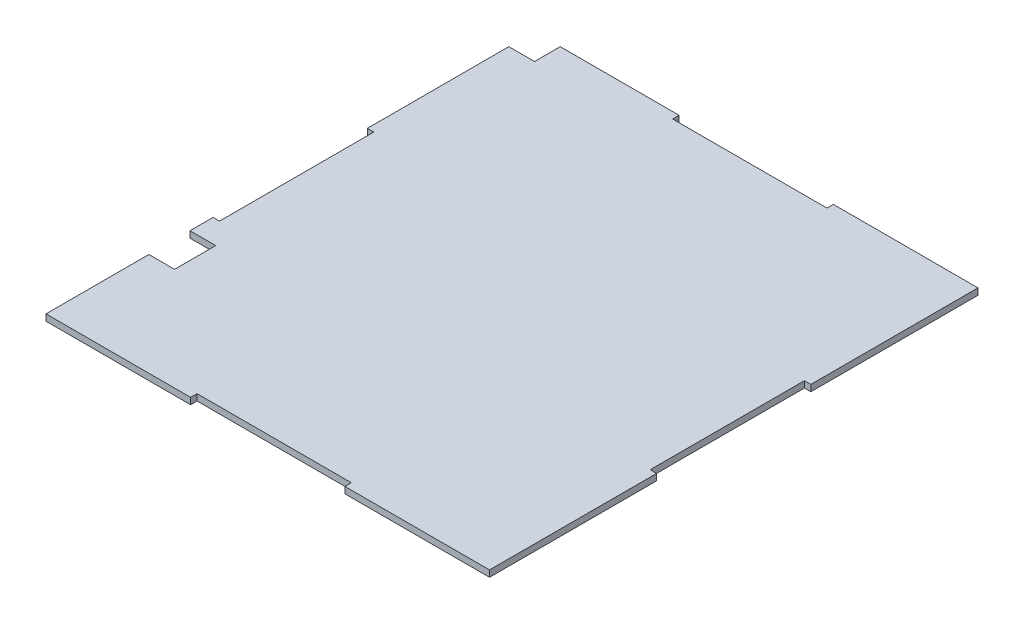
ISO-10303-21;
HEADER;
FILE_DESCRIPTION(('STEP AP214'),'2;1');
FILE_NAME('part.step','',(''),(''),'','','');
FILE_SCHEMA(('AUTOMOTIVE_DESIGN { 1 0 10303 214 1 1 1 1 }'));
ENDSEC;
DATA;
#1=APPLICATION_CONTEXT('core data for automotive mechanical design processes');
#2=APPLICATION_PROTOCOL_DEFINITION('international standard','automotive_design',2000,#1);
#3=PRODUCT_CONTEXT('',#1,'mechanical');
#4=PRODUCT('Part','Part','',(#3));
#5=PRODUCT_RELATED_PRODUCT_CATEGORY('part','',(#4));
#6=PRODUCT_DEFINITION_FORMATION('','',#4);
#7=PRODUCT_DEFINITION_CONTEXT('part definition',#1,'design');
#8=PRODUCT_DEFINITION('design','',#6,#7);
#9=PRODUCT_DEFINITION_SHAPE('','',#8);
#10=(LENGTH_UNIT() NAMED_UNIT(*) SI_UNIT(.MILLI.,.METRE.));
#11=(NAMED_UNIT(*) PLANE_ANGLE_UNIT() SI_UNIT($,.RADIAN.));
#12=(NAMED_UNIT(*) SI_UNIT($,.STERADIAN.) SOLID_ANGLE_UNIT());
#13=UNCERTAINTY_MEASURE_WITH_UNIT(LENGTH_MEASURE(1.E-05),#10,'distance_accuracy_value','');
#14=(GEOMETRIC_REPRESENTATION_CONTEXT(3) GLOBAL_UNCERTAINTY_ASSIGNED_CONTEXT((#13)) GLOBAL_UNIT_ASSIGNED_CONTEXT((#10,
#11,#12)) REPRESENTATION_CONTEXT('',''));
#15=CARTESIAN_POINT('',(0.,0.,0.));
#16=DIRECTION('',(0.,0.,1.));
#17=DIRECTION('',(1.,0.,0.));
#18=AXIS2_PLACEMENT_3D('',#15,#16,#17);
#19=CARTESIAN_POINT('',(0.,3.175,0.));
#20=DIRECTION('',(1.,0.,0.));
#21=DIRECTION('',(0.,0.,-1.));
#22=AXIS2_PLACEMENT_3D('',#19,#20,#21);
#23=PLANE('',#22);
#24=DIRECTION('',(0.,0.,1.));
#25=VECTOR('',#24,1.);
#26=CARTESIAN_POINT('',(0.,0.,0.));
#27=LINE('',#26,#25);
#28=CARTESIAN_POINT('',(0.,0.,-82.55));
#29=VERTEX_POINT('',#28);
#30=CARTESIAN_POINT('',(0.,0.,-71.12));
#31=VERTEX_POINT('',#30);
#32=EDGE_CURVE('E233',#29,#31,#27,.T.);
#33=ORIENTED_EDGE('',*,*,#32,.T.);
#34=DIRECTION('',(0.,1.,0.));
#35=VECTOR('',#34,1.);
#36=CARTESIAN_POINT('',(0.,0.,-71.12));
#37=LINE('',#36,#35);
#38=CARTESIAN_POINT('',(0.,3.175,-71.12));
#39=VERTEX_POINT('',#38);
#40=EDGE_CURVE('E314',#31,#39,#37,.T.);
#41=ORIENTED_EDGE('',*,*,#40,.T.);
#42=DIRECTION('',(0.,0.,1.));
#43=VECTOR('',#42,1.);
#44=CARTESIAN_POINT('',(0.,3.175,0.));
#45=LINE('',#44,#43);
#46=CARTESIAN_POINT('',(0.,3.175,-82.55));
#47=VERTEX_POINT('',#46);
#48=EDGE_CURVE('E259',#47,#39,#45,.T.);
#49=ORIENTED_EDGE('',*,*,#48,.F.);
#50=DIRECTION('',(0.,1.,0.));
#51=VECTOR('',#50,1.);
#52=CARTESIAN_POINT('',(0.,0.,-82.55));
#53=LINE('',#52,#51);
#54=EDGE_CURVE('E255',#29,#47,#53,.T.);
#55=ORIENTED_EDGE('',*,*,#54,.F.);
#56=EDGE_LOOP('',(#33,#41,#49,#55));
#57=FACE_BOUND('',#56,.T.);
#58=ADVANCED_FACE('F36',(#57),#23,.F.);
#59=CARTESIAN_POINT('',(0.,3.175,0.));
#60=DIRECTION('',(0.,0.,-1.));
#61=DIRECTION('',(-1.,0.,0.));
#62=AXIS2_PLACEMENT_3D('',#59,#60,#61);
#63=PLANE('',#62);
#64=DIRECTION('',(1.,0.,0.));
#65=VECTOR('',#64,1.);
#66=CARTESIAN_POINT('',(0.,0.,0.));
#67=LINE('',#66,#65);
#68=CARTESIAN_POINT('',(0.,0.,0.));
#69=VERTEX_POINT('',#68);
#70=CARTESIAN_POINT('',(71.4374999999998,0.,0.));
#71=VERTEX_POINT('',#70);
#72=EDGE_CURVE('E236',#69,#71,#67,.T.);
#73=ORIENTED_EDGE('',*,*,#72,.T.);
#74=DIRECTION('',(0.,1.,0.));
#75=VECTOR('',#74,1.);
#76=CARTESIAN_POINT('',(71.4374999999998,0.,0.));
#77=LINE('',#76,#75);
#78=CARTESIAN_POINT('',(71.4374999999998,3.175,0.));
#79=VERTEX_POINT('',#78);
#80=EDGE_CURVE('E384',#71,#79,#77,.T.);
#81=ORIENTED_EDGE('',*,*,#80,.T.);
#82=DIRECTION('',(1.,0.,0.));
#83=VECTOR('',#82,1.);
#84=CARTESIAN_POINT('',(0.,3.175,0.));
#85=LINE('',#84,#83);
#86=CARTESIAN_POINT('',(0.,3.175,0.));
#87=VERTEX_POINT('',#86);
#88=EDGE_CURVE('E261',#87,#79,#85,.T.);
#89=ORIENTED_EDGE('',*,*,#88,.F.);
#90=DIRECTION('',(0.,-1.,0.));
#91=VECTOR('',#90,1.);
#92=CARTESIAN_POINT('',(0.,3.175,0.));
#93=LINE('',#92,#91);
#94=EDGE_CURVE('E11',#87,#69,#93,.T.);
#95=ORIENTED_EDGE('',*,*,#94,.T.);
#96=EDGE_LOOP('',(#73,#81,#89,#95));
#97=FACE_BOUND('',#96,.T.);
#98=ADVANCED_FACE('F454',(#97),#63,.F.);
#99=CARTESIAN_POINT('',(219.075,3.175,0.));
#100=DIRECTION('',(-1.,0.,0.));
#101=DIRECTION('',(0.,0.,1.));
#102=AXIS2_PLACEMENT_3D('',#99,#100,#101);
#103=PLANE('',#102);
#104=DIRECTION('',(0.,0.,-1.));
#105=VECTOR('',#104,1.);
#106=CARTESIAN_POINT('',(219.075,3.175,0.));
#107=LINE('',#106,#105);
#108=CARTESIAN_POINT('',(219.075,3.175,-158.75));
#109=VERTEX_POINT('',#108);
#110=CARTESIAN_POINT('',(219.075,3.175,-241.3));
#111=VERTEX_POINT('',#110);
#112=EDGE_CURVE('E264',#109,#111,#107,.T.);
#113=ORIENTED_EDGE('',*,*,#112,.F.);
#114=DIRECTION('',(0.,1.,0.));
#115=VECTOR('',#114,1.);
#116=CARTESIAN_POINT('',(219.075,0.,-158.75));
#117=LINE('',#116,#115);
#118=CARTESIAN_POINT('',(219.075,0.,-158.75));
#119=VERTEX_POINT('',#118);
#120=EDGE_CURVE('E345',#119,#109,#117,.T.);
#121=ORIENTED_EDGE('',*,*,#120,.F.);
#122=DIRECTION('',(0.,0.,-1.));
#123=VECTOR('',#122,1.);
#124=CARTESIAN_POINT('',(219.075,0.,0.));
#125=LINE('',#124,#123);
#126=CARTESIAN_POINT('',(219.075,0.,-241.3));
#127=VERTEX_POINT('',#126);
#128=EDGE_CURVE('E421',#119,#127,#125,.T.);
#129=ORIENTED_EDGE('',*,*,#128,.T.);
#130=DIRECTION('',(0.,-1.,0.));
#131=VECTOR('',#130,1.);
#132=CARTESIAN_POINT('',(219.075,3.175,-241.3));
#133=LINE('',#132,#131);
#134=EDGE_CURVE('E270',#111,#127,#133,.T.);
#135=ORIENTED_EDGE('',*,*,#134,.F.);
#136=EDGE_LOOP('',(#113,#121,#129,#135));
#137=FACE_BOUND('',#136,.T.);
#138=ADVANCED_FACE('F479',(#137),#103,.F.);
#139=CARTESIAN_POINT('',(0.,3.175,-241.3));
#140=DIRECTION('',(0.,0.,1.));
#141=DIRECTION('',(1.,0.,0.));
#142=AXIS2_PLACEMENT_3D('',#139,#140,#141);
#143=PLANE('',#142);
#144=DIRECTION('',(-1.,0.,0.));
#145=VECTOR('',#144,1.);
#146=CARTESIAN_POINT('',(0.,0.,-241.3));
#147=LINE('',#146,#145);
#148=CARTESIAN_POINT('',(147.6375,0.,-241.3));
#149=VERTEX_POINT('',#148);
#150=EDGE_CURVE('E416',#127,#149,#147,.T.);
#151=ORIENTED_EDGE('',*,*,#150,.T.);
#152=DIRECTION('',(0.,1.,0.));
#153=VECTOR('',#152,1.);
#154=CARTESIAN_POINT('',(147.6375,0.,-241.3));
#155=LINE('',#154,#153);
#156=CARTESIAN_POINT('',(147.6375,3.175,-241.3));
#157=VERTEX_POINT('',#156);
#158=EDGE_CURVE('E361',#149,#157,#155,.T.);
#159=ORIENTED_EDGE('',*,*,#158,.T.);
#160=DIRECTION('',(-1.,0.,0.));
#161=VECTOR('',#160,1.);
#162=CARTESIAN_POINT('',(0.,3.175,-241.3));
#163=LINE('',#162,#161);
#164=EDGE_CURVE('E268',#111,#157,#163,.T.);
#165=ORIENTED_EDGE('',*,*,#164,.F.);
#166=ORIENTED_EDGE('',*,*,#134,.T.);
#167=EDGE_LOOP('',(#151,#159,#165,#166));
#168=FACE_BOUND('',#167,.T.);
#169=ADVANCED_FACE('F474',(#168),#143,.F.);
#170=CARTESIAN_POINT('',(0.,3.175,-228.6));
#171=VERTEX_POINT('',#170);
#172=CARTESIAN_POINT('',(0.,3.175,-158.75));
#173=VERTEX_POINT('',#172);
#174=EDGE_CURVE('E225',#171,#173,#45,.T.);
#175=ORIENTED_EDGE('',*,*,#174,.F.);
#176=DIRECTION('',(0.,1.,0.));
#177=VECTOR('',#176,1.);
#178=CARTESIAN_POINT('',(0.,0.,-228.6));
#179=LINE('',#178,#177);
#180=CARTESIAN_POINT('',(0.,0.,-228.6));
#181=VERTEX_POINT('',#180);
#182=EDGE_CURVE('E212',#181,#171,#179,.T.);
#183=ORIENTED_EDGE('',*,*,#182,.F.);
#184=CARTESIAN_POINT('',(0.,0.,-158.75));
#185=VERTEX_POINT('',#184);
#186=EDGE_CURVE('E223',#181,#185,#27,.T.);
#187=ORIENTED_EDGE('',*,*,#186,.T.);
#188=DIRECTION('',(0.,1.,0.));
#189=VECTOR('',#188,1.);
#190=CARTESIAN_POINT('',(0.,0.,-158.75));
#191=LINE('',#190,#189);
#192=EDGE_CURVE('E240',#185,#173,#191,.T.);
#193=ORIENTED_EDGE('',*,*,#192,.T.);
#194=EDGE_LOOP('',(#175,#183,#187,#193));
#195=FACE_BOUND('',#194,.T.);
#196=ADVANCED_FACE('F221',(#195),#23,.F.);
#197=CARTESIAN_POINT('',(0.,3.175,-50.8));
#198=VERTEX_POINT('',#197);
#199=EDGE_CURVE('E260',#198,#87,#45,.T.);
#200=ORIENTED_EDGE('',*,*,#199,.F.);
#201=DIRECTION('',(0.,1.,0.));
#202=VECTOR('',#201,1.);
#203=CARTESIAN_POINT('',(0.,0.,-50.8));
#204=LINE('',#203,#202);
#205=CARTESIAN_POINT('',(0.,0.,-50.8));
#206=VERTEX_POINT('',#205);
#207=EDGE_CURVE('E309',#206,#198,#204,.T.);
#208=ORIENTED_EDGE('',*,*,#207,.F.);
#209=EDGE_CURVE('E235',#206,#69,#27,.T.);
#210=ORIENTED_EDGE('',*,*,#209,.T.);
#211=ORIENTED_EDGE('',*,*,#94,.F.);
#212=EDGE_LOOP('',(#200,#208,#210,#211));
#213=FACE_BOUND('',#212,.T.);
#214=ADVANCED_FACE('F38',(#213),#23,.F.);
#215=CARTESIAN_POINT('',(147.6375,3.175,0.));
#216=VERTEX_POINT('',#215);
#217=CARTESIAN_POINT('',(219.075,3.175,0.));
#218=VERTEX_POINT('',#217);
#219=EDGE_CURVE('E258',#216,#218,#85,.T.);
#220=ORIENTED_EDGE('',*,*,#219,.F.);
#221=DIRECTION('',(0.,1.,0.));
#222=VECTOR('',#221,1.);
#223=CARTESIAN_POINT('',(147.6375,0.,0.));
#224=LINE('',#223,#222);
#225=CARTESIAN_POINT('',(147.6375,0.,0.));
#226=VERTEX_POINT('',#225);
#227=EDGE_CURVE('E394',#226,#216,#224,.T.);
#228=ORIENTED_EDGE('',*,*,#227,.F.);
#229=CARTESIAN_POINT('',(219.075,0.,0.));
#230=VERTEX_POINT('',#229);
#231=EDGE_CURVE('E232',#226,#230,#67,.T.);
#232=ORIENTED_EDGE('',*,*,#231,.T.);
#233=DIRECTION('',(0.,-1.,0.));
#234=VECTOR('',#233,1.);
#235=CARTESIAN_POINT('',(219.075,3.175,0.));
#236=LINE('',#235,#234);
#237=EDGE_CURVE('E44',#218,#230,#236,.T.);
#238=ORIENTED_EDGE('',*,*,#237,.F.);
#239=EDGE_LOOP('',(#220,#228,#232,#238));
#240=FACE_BOUND('',#239,.T.);
#241=ADVANCED_FACE('F441',(#240),#63,.F.);
#242=CARTESIAN_POINT('',(219.075,0.,-82.55));
#243=VERTEX_POINT('',#242);
#244=EDGE_CURVE('E417',#230,#243,#125,.T.);
#245=ORIENTED_EDGE('',*,*,#244,.T.);
#246=DIRECTION('',(0.,1.,0.));
#247=VECTOR('',#246,1.);
#248=CARTESIAN_POINT('',(219.075,0.,-82.55));
#249=LINE('',#248,#247);
#250=CARTESIAN_POINT('',(219.075,3.175,-82.55));
#251=VERTEX_POINT('',#250);
#252=EDGE_CURVE('E347',#243,#251,#249,.T.);
#253=ORIENTED_EDGE('',*,*,#252,.T.);
#254=EDGE_CURVE('E265',#218,#251,#107,.T.);
#255=ORIENTED_EDGE('',*,*,#254,.F.);
#256=ORIENTED_EDGE('',*,*,#237,.T.);
#257=EDGE_LOOP('',(#245,#253,#255,#256));
#258=FACE_BOUND('',#257,.T.);
#259=ADVANCED_FACE('F428',(#258),#103,.F.);
#260=CARTESIAN_POINT('',(71.4374999999998,0.,-241.3));
#261=VERTEX_POINT('',#260);
#262=CARTESIAN_POINT('',(12.7,0.,-241.3));
#263=VERTEX_POINT('',#262);
#264=EDGE_CURVE('E292',#261,#263,#147,.T.);
#265=ORIENTED_EDGE('',*,*,#264,.T.);
#266=DIRECTION('',(0.,1.,0.));
#267=VECTOR('',#266,1.);
#268=CARTESIAN_POINT('',(12.7,0.,-241.3));
#269=LINE('',#268,#267);
#270=CARTESIAN_POINT('',(12.7,3.175,-241.3));
#271=VERTEX_POINT('',#270);
#272=EDGE_CURVE('E291',#263,#271,#269,.T.);
#273=ORIENTED_EDGE('',*,*,#272,.T.);
#274=CARTESIAN_POINT('',(71.4374999999998,3.175,-241.3));
#275=VERTEX_POINT('',#274);
#276=EDGE_CURVE('E267',#275,#271,#163,.T.);
#277=ORIENTED_EDGE('',*,*,#276,.F.);
#278=DIRECTION('',(0.,1.,0.));
#279=VECTOR('',#278,1.);
#280=CARTESIAN_POINT('',(71.4374999999998,0.,-241.3));
#281=LINE('',#280,#279);
#282=EDGE_CURVE('E289',#261,#275,#281,.T.);
#283=ORIENTED_EDGE('',*,*,#282,.F.);
#284=EDGE_LOOP('',(#265,#273,#277,#283));
#285=FACE_BOUND('',#284,.T.);
#286=ADVANCED_FACE('F288',(#285),#143,.F.);
#287=CARTESIAN_POINT('',(0.,3.175,0.));
#288=DIRECTION('',(0.,-1.,0.));
#289=DIRECTION('',(0.,0.,-1.));
#290=AXIS2_PLACEMENT_3D('',#287,#288,#289);
#291=PLANE('',#290);
#292=ORIENTED_EDGE('',*,*,#276,.T.);
#293=DIRECTION('',(0.,0.,-1.));
#294=VECTOR('',#293,1.);
#295=CARTESIAN_POINT('',(12.7,3.175,-241.3));
#296=LINE('',#295,#294);
#297=CARTESIAN_POINT('',(12.7,3.175,-228.6));
#298=VERTEX_POINT('',#297);
#299=EDGE_CURVE('E217',#298,#271,#296,.T.);
#300=ORIENTED_EDGE('',*,*,#299,.F.);
#301=DIRECTION('',(1.,0.,0.));
#302=VECTOR('',#301,1.);
#303=CARTESIAN_POINT('',(0.,3.175,-228.6));
#304=LINE('',#303,#302);
#305=EDGE_CURVE('E414',#171,#298,#304,.T.);
#306=ORIENTED_EDGE('',*,*,#305,.F.);
#307=ORIENTED_EDGE('',*,*,#174,.T.);
#308=DIRECTION('',(-1.,0.,0.));
#309=VECTOR('',#308,1.);
#310=CARTESIAN_POINT('',(3.17500000000001,3.175,-158.75));
#311=LINE('',#310,#309);
#312=CARTESIAN_POINT('',(3.17500000000001,3.175,-158.75));
#313=VERTEX_POINT('',#312);
#314=EDGE_CURVE('E251',#313,#173,#311,.T.);
#315=ORIENTED_EDGE('',*,*,#314,.F.);
#316=DIRECTION('',(0.,0.,-1.));
#317=VECTOR('',#316,1.);
#318=CARTESIAN_POINT('',(3.17500000000001,3.175,-158.75));
#319=LINE('',#318,#317);
#320=CARTESIAN_POINT('',(3.17500000000002,3.175,-82.55));
#321=VERTEX_POINT('',#320);
#322=EDGE_CURVE('E405',#321,#313,#319,.T.);
#323=ORIENTED_EDGE('',*,*,#322,.F.);
#324=DIRECTION('',(1.,0.,0.));
#325=VECTOR('',#324,1.);
#326=CARTESIAN_POINT('',(3.17500000000002,3.175,-82.55));
#327=LINE('',#326,#325);
#328=EDGE_CURVE('E344',#47,#321,#327,.T.);
#329=ORIENTED_EDGE('',*,*,#328,.F.);
#330=ORIENTED_EDGE('',*,*,#48,.T.);
#331=DIRECTION('',(-1.,0.,0.));
#332=VECTOR('',#331,1.);
#333=CARTESIAN_POINT('',(0.,3.175,-71.12));
#334=LINE('',#333,#332);
#335=CARTESIAN_POINT('',(12.7,3.175,-71.12));
#336=VERTEX_POINT('',#335);
#337=EDGE_CURVE('E305',#336,#39,#334,.T.);
#338=ORIENTED_EDGE('',*,*,#337,.F.);
#339=DIRECTION('',(0.,0.,-1.));
#340=VECTOR('',#339,1.);
#341=CARTESIAN_POINT('',(12.7,3.175,-71.12));
#342=LINE('',#341,#340);
#343=CARTESIAN_POINT('',(12.7,3.175,-50.8));
#344=VERTEX_POINT('',#343);
#345=EDGE_CURVE('E296',#344,#336,#342,.T.);
#346=ORIENTED_EDGE('',*,*,#345,.F.);
#347=DIRECTION('',(1.,0.,0.));
#348=VECTOR('',#347,1.);
#349=CARTESIAN_POINT('',(0.,3.175,-50.8));
#350=LINE('',#349,#348);
#351=EDGE_CURVE('E293',#198,#344,#350,.T.);
#352=ORIENTED_EDGE('',*,*,#351,.F.);
#353=ORIENTED_EDGE('',*,*,#199,.T.);
#354=ORIENTED_EDGE('',*,*,#88,.T.);
#355=DIRECTION('',(0.,0.,1.));
#356=VECTOR('',#355,1.);
#357=CARTESIAN_POINT('',(71.4374999999998,3.175,0.));
#358=LINE('',#357,#356);
#359=CARTESIAN_POINT('',(71.4374999999998,3.175,-3.17500000000001));
#360=VERTEX_POINT('',#359);
#361=EDGE_CURVE('E317',#360,#79,#358,.T.);
#362=ORIENTED_EDGE('',*,*,#361,.F.);
#363=DIRECTION('',(-1.,0.,0.));
#364=VECTOR('',#363,1.);
#365=CARTESIAN_POINT('',(71.4374999999998,3.175,-3.17500000000001));
#366=LINE('',#365,#364);
#367=CARTESIAN_POINT('',(147.6375,3.175,-3.17499999999998));
#368=VERTEX_POINT('',#367);
#369=EDGE_CURVE('E378',#368,#360,#366,.T.);
#370=ORIENTED_EDGE('',*,*,#369,.F.);
#371=DIRECTION('',(0.,0.,-1.));
#372=VECTOR('',#371,1.);
#373=CARTESIAN_POINT('',(147.6375,3.175,0.));
#374=LINE('',#373,#372);
#375=EDGE_CURVE('E386',#216,#368,#374,.T.);
#376=ORIENTED_EDGE('',*,*,#375,.F.);
#377=ORIENTED_EDGE('',*,*,#219,.T.);
#378=ORIENTED_EDGE('',*,*,#254,.T.);
#379=DIRECTION('',(1.,0.,0.));
#380=VECTOR('',#379,1.);
#381=CARTESIAN_POINT('',(215.9,3.175,-82.55));
#382=LINE('',#381,#380);
#383=CARTESIAN_POINT('',(215.9,3.175,-82.55));
#384=VERTEX_POINT('',#383);
#385=EDGE_CURVE('E337',#384,#251,#382,.T.);
#386=ORIENTED_EDGE('',*,*,#385,.F.);
#387=DIRECTION('',(0.,0.,1.));
#388=VECTOR('',#387,1.);
#389=CARTESIAN_POINT('',(215.9,3.175,-158.75));
#390=LINE('',#389,#388);
#391=CARTESIAN_POINT('',(215.9,3.175,-158.75));
#392=VERTEX_POINT('',#391);
#393=EDGE_CURVE('E334',#392,#384,#390,.T.);
#394=ORIENTED_EDGE('',*,*,#393,.F.);
#395=DIRECTION('',(-1.,0.,0.));
#396=VECTOR('',#395,1.);
#397=CARTESIAN_POINT('',(215.9,3.175,-158.75));
#398=LINE('',#397,#396);
#399=EDGE_CURVE('E327',#109,#392,#398,.T.);
#400=ORIENTED_EDGE('',*,*,#399,.F.);
#401=ORIENTED_EDGE('',*,*,#112,.T.);
#402=ORIENTED_EDGE('',*,*,#164,.T.);
#403=DIRECTION('',(0.,0.,-1.));
#404=VECTOR('',#403,1.);
#405=CARTESIAN_POINT('',(147.6375,3.175,-241.3));
#406=LINE('',#405,#404);
#407=CARTESIAN_POINT('',(147.6375,3.175,-238.125));
#408=VERTEX_POINT('',#407);
#409=EDGE_CURVE('E362',#408,#157,#406,.T.);
#410=ORIENTED_EDGE('',*,*,#409,.F.);
#411=DIRECTION('',(1.,0.,0.));
#412=VECTOR('',#411,1.);
#413=CARTESIAN_POINT('',(71.4374999999998,3.175,-238.125));
#414=LINE('',#413,#412);
#415=CARTESIAN_POINT('',(71.4374999999998,3.175,-238.125));
#416=VERTEX_POINT('',#415);
#417=EDGE_CURVE('E355',#416,#408,#414,.T.);
#418=ORIENTED_EDGE('',*,*,#417,.F.);
#419=DIRECTION('',(0.,0.,1.));
#420=VECTOR('',#419,1.);
#421=CARTESIAN_POINT('',(71.4374999999998,3.175,-241.3));
#422=LINE('',#421,#420);
#423=EDGE_CURVE('E283',#275,#416,#422,.T.);
#424=ORIENTED_EDGE('',*,*,#423,.F.);
#425=EDGE_LOOP('',(#292,#300,#306,#307,#315,#323,#329,#330,#338,#346,#352,#353,#354,#362,#370,
#376,#377,#378,#386,#394,#400,#401,#402,#410,#418,#424));
#426=FACE_BOUND('',#425,.T.);
#427=ADVANCED_FACE('F280',(#426),#291,.F.);
#428=CARTESIAN_POINT('',(0.,0.,0.));
#429=DIRECTION('',(0.,-1.,0.));
#430=DIRECTION('',(0.,0.,-1.));
#431=AXIS2_PLACEMENT_3D('',#428,#429,#430);
#432=PLANE('',#431);
#433=DIRECTION('',(0.,0.,-1.));
#434=VECTOR('',#433,1.);
#435=CARTESIAN_POINT('',(12.7,0.,-241.3));
#436=LINE('',#435,#434);
#437=CARTESIAN_POINT('',(12.7,0.,-228.6));
#438=VERTEX_POINT('',#437);
#439=EDGE_CURVE('E51',#438,#263,#436,.T.);
#440=ORIENTED_EDGE('',*,*,#439,.T.);
#441=ORIENTED_EDGE('',*,*,#264,.F.);
#442=DIRECTION('',(0.,0.,1.));
#443=VECTOR('',#442,1.);
#444=CARTESIAN_POINT('',(71.4374999999998,0.,-241.3));
#445=LINE('',#444,#443);
#446=CARTESIAN_POINT('',(71.4374999999998,0.,-238.125));
#447=VERTEX_POINT('',#446);
#448=EDGE_CURVE('E354',#261,#447,#445,.T.);
#449=ORIENTED_EDGE('',*,*,#448,.T.);
#450=DIRECTION('',(1.,0.,0.));
#451=VECTOR('',#450,1.);
#452=CARTESIAN_POINT('',(71.4374999999998,0.,-238.125));
#453=LINE('',#452,#451);
#454=CARTESIAN_POINT('',(147.6375,0.,-238.125));
#455=VERTEX_POINT('',#454);
#456=EDGE_CURVE('E358',#447,#455,#453,.T.);
#457=ORIENTED_EDGE('',*,*,#456,.T.);
#458=DIRECTION('',(0.,0.,-1.));
#459=VECTOR('',#458,1.);
#460=CARTESIAN_POINT('',(147.6375,0.,-241.3));
#461=LINE('',#460,#459);
#462=EDGE_CURVE('E351',#455,#149,#461,.T.);
#463=ORIENTED_EDGE('',*,*,#462,.T.);
#464=ORIENTED_EDGE('',*,*,#150,.F.);
#465=ORIENTED_EDGE('',*,*,#128,.F.);
#466=DIRECTION('',(-1.,0.,0.));
#467=VECTOR('',#466,1.);
#468=CARTESIAN_POINT('',(215.9,0.,-158.75));
#469=LINE('',#468,#467);
#470=CARTESIAN_POINT('',(215.9,0.,-158.75));
#471=VERTEX_POINT('',#470);
#472=EDGE_CURVE('E330',#119,#471,#469,.T.);
#473=ORIENTED_EDGE('',*,*,#472,.T.);
#474=DIRECTION('',(0.,0.,1.));
#475=VECTOR('',#474,1.);
#476=CARTESIAN_POINT('',(215.9,0.,-158.75));
#477=LINE('',#476,#475);
#478=CARTESIAN_POINT('',(215.9,0.,-82.55));
#479=VERTEX_POINT('',#478);
#480=EDGE_CURVE('E323',#471,#479,#477,.T.);
#481=ORIENTED_EDGE('',*,*,#480,.T.);
#482=DIRECTION('',(1.,0.,0.));
#483=VECTOR('',#482,1.);
#484=CARTESIAN_POINT('',(215.9,0.,-82.55));
#485=LINE('',#484,#483);
#486=EDGE_CURVE('E326',#479,#243,#485,.T.);
#487=ORIENTED_EDGE('',*,*,#486,.T.);
#488=ORIENTED_EDGE('',*,*,#244,.F.);
#489=ORIENTED_EDGE('',*,*,#231,.F.);
#490=DIRECTION('',(0.,0.,-1.));
#491=VECTOR('',#490,1.);
#492=CARTESIAN_POINT('',(147.6375,0.,0.));
#493=LINE('',#492,#491);
#494=CARTESIAN_POINT('',(147.6375,0.,-3.17499999999998));
#495=VERTEX_POINT('',#494);
#496=EDGE_CURVE('E377',#226,#495,#493,.T.);
#497=ORIENTED_EDGE('',*,*,#496,.T.);
#498=DIRECTION('',(-1.,0.,0.));
#499=VECTOR('',#498,1.);
#500=CARTESIAN_POINT('',(71.4374999999998,0.,-3.17500000000001));
#501=LINE('',#500,#499);
#502=CARTESIAN_POINT('',(71.4374999999998,0.,-3.17500000000001));
#503=VERTEX_POINT('',#502);
#504=EDGE_CURVE('E381',#495,#503,#501,.T.);
#505=ORIENTED_EDGE('',*,*,#504,.T.);
#506=DIRECTION('',(0.,0.,1.));
#507=VECTOR('',#506,1.);
#508=CARTESIAN_POINT('',(71.4374999999998,0.,0.));
#509=LINE('',#508,#507);
#510=EDGE_CURVE('E374',#503,#71,#509,.T.);
#511=ORIENTED_EDGE('',*,*,#510,.T.);
#512=ORIENTED_EDGE('',*,*,#72,.F.);
#513=ORIENTED_EDGE('',*,*,#209,.F.);
#514=DIRECTION('',(1.,0.,0.));
#515=VECTOR('',#514,1.);
#516=CARTESIAN_POINT('',(0.,0.,-50.8));
#517=LINE('',#516,#515);
#518=CARTESIAN_POINT('',(12.7,0.,-50.8));
#519=VERTEX_POINT('',#518);
#520=EDGE_CURVE('E302',#206,#519,#517,.T.);
#521=ORIENTED_EDGE('',*,*,#520,.T.);
#522=DIRECTION('',(0.,0.,-1.));
#523=VECTOR('',#522,1.);
#524=CARTESIAN_POINT('',(12.7,0.,-71.12));
#525=LINE('',#524,#523);
#526=CARTESIAN_POINT('',(12.7,0.,-71.12));
#527=VERTEX_POINT('',#526);
#528=EDGE_CURVE('E59',#519,#527,#525,.T.);
#529=ORIENTED_EDGE('',*,*,#528,.T.);
#530=DIRECTION('',(-1.,0.,0.));
#531=VECTOR('',#530,1.);
#532=CARTESIAN_POINT('',(0.,0.,-71.12));
#533=LINE('',#532,#531);
#534=EDGE_CURVE('E307',#527,#31,#533,.T.);
#535=ORIENTED_EDGE('',*,*,#534,.T.);
#536=ORIENTED_EDGE('',*,*,#32,.F.);
#537=DIRECTION('',(1.,0.,0.));
#538=VECTOR('',#537,1.);
#539=CARTESIAN_POINT('',(3.17500000000002,0.,-82.55));
#540=LINE('',#539,#538);
#541=CARTESIAN_POINT('',(3.17500000000002,0.,-82.55));
#542=VERTEX_POINT('',#541);
#543=EDGE_CURVE('E398',#29,#542,#540,.T.);
#544=ORIENTED_EDGE('',*,*,#543,.T.);
#545=DIRECTION('',(0.,0.,-1.));
#546=VECTOR('',#545,1.);
#547=CARTESIAN_POINT('',(3.17500000000001,0.,-158.75));
#548=LINE('',#547,#546);
#549=CARTESIAN_POINT('',(3.17500000000001,0.,-158.75));
#550=VERTEX_POINT('',#549);
#551=EDGE_CURVE('E401',#542,#550,#548,.T.);
#552=ORIENTED_EDGE('',*,*,#551,.T.);
#553=DIRECTION('',(-1.,0.,0.));
#554=VECTOR('',#553,1.);
#555=CARTESIAN_POINT('',(3.17500000000001,0.,-158.75));
#556=LINE('',#555,#554);
#557=EDGE_CURVE('E231',#550,#185,#556,.T.);
#558=ORIENTED_EDGE('',*,*,#557,.T.);
#559=ORIENTED_EDGE('',*,*,#186,.F.);
#560=DIRECTION('',(1.,0.,0.));
#561=VECTOR('',#560,1.);
#562=CARTESIAN_POINT('',(0.,0.,-228.6));
#563=LINE('',#562,#561);
#564=EDGE_CURVE('E208',#181,#438,#563,.T.);
#565=ORIENTED_EDGE('',*,*,#564,.T.);
#566=EDGE_LOOP('',(#440,#441,#449,#457,#463,#464,#465,#473,#481,#487,#488,#489,#497,#505,#511,
#512,#513,#521,#529,#535,#536,#544,#552,#558,#559,#565));
#567=FACE_BOUND('',#566,.T.);
#568=ADVANCED_FACE('F228',(#567),#432,.T.);
#569=CARTESIAN_POINT('',(3.17500000000001,0.,-158.75));
#570=DIRECTION('',(0.,0.,-1.));
#571=DIRECTION('',(-1.,0.,0.));
#572=AXIS2_PLACEMENT_3D('',#569,#570,#571);
#573=PLANE('',#572);
#574=ORIENTED_EDGE('',*,*,#314,.T.);
#575=ORIENTED_EDGE('',*,*,#192,.F.);
#576=ORIENTED_EDGE('',*,*,#557,.F.);
#577=DIRECTION('',(0.,1.,0.));
#578=VECTOR('',#577,1.);
#579=CARTESIAN_POINT('',(3.17500000000001,0.,-158.75));
#580=LINE('',#579,#578);
#581=EDGE_CURVE('E246',#550,#313,#580,.T.);
#582=ORIENTED_EDGE('',*,*,#581,.T.);
#583=EDGE_LOOP('',(#574,#575,#576,#582));
#584=FACE_BOUND('',#583,.T.);
#585=ADVANCED_FACE('F412',(#584),#573,.F.);
#586=CARTESIAN_POINT('',(3.17500000000001,0.,-158.75));
#587=DIRECTION('',(1.,0.,0.));
#588=DIRECTION('',(0.,0.,-1.));
#589=AXIS2_PLACEMENT_3D('',#586,#587,#588);
#590=PLANE('',#589);
#591=ORIENTED_EDGE('',*,*,#322,.T.);
#592=ORIENTED_EDGE('',*,*,#581,.F.);
#593=ORIENTED_EDGE('',*,*,#551,.F.);
#594=DIRECTION('',(0.,1.,0.));
#595=VECTOR('',#594,1.);
#596=CARTESIAN_POINT('',(3.17500000000002,0.,-82.55));
#597=LINE('',#596,#595);
#598=EDGE_CURVE('E248',#542,#321,#597,.T.);
#599=ORIENTED_EDGE('',*,*,#598,.T.);
#600=EDGE_LOOP('',(#591,#592,#593,#599));
#601=FACE_BOUND('',#600,.T.);
#602=ADVANCED_FACE('F496',(#601),#590,.F.);
#603=CARTESIAN_POINT('',(3.17500000000002,0.,-82.55));
#604=DIRECTION('',(0.,0.,1.));
#605=DIRECTION('',(1.,0.,0.));
#606=AXIS2_PLACEMENT_3D('',#603,#604,#605);
#607=PLANE('',#606);
#608=ORIENTED_EDGE('',*,*,#328,.T.);
#609=ORIENTED_EDGE('',*,*,#598,.F.);
#610=ORIENTED_EDGE('',*,*,#543,.F.);
#611=ORIENTED_EDGE('',*,*,#54,.T.);
#612=EDGE_LOOP('',(#608,#609,#610,#611));
#613=FACE_BOUND('',#612,.T.);
#614=ADVANCED_FACE('F493',(#613),#607,.F.);
#615=CARTESIAN_POINT('',(71.4374999999998,0.,0.));
#616=DIRECTION('',(-1.,0.,0.));
#617=DIRECTION('',(0.,0.,1.));
#618=AXIS2_PLACEMENT_3D('',#615,#616,#617);
#619=PLANE('',#618);
#620=ORIENTED_EDGE('',*,*,#361,.T.);
#621=ORIENTED_EDGE('',*,*,#80,.F.);
#622=ORIENTED_EDGE('',*,*,#510,.F.);
#623=DIRECTION('',(0.,1.,0.));
#624=VECTOR('',#623,1.);
#625=CARTESIAN_POINT('',(71.4374999999998,0.,-3.17500000000001));
#626=LINE('',#625,#624);
#627=EDGE_CURVE('E364',#503,#360,#626,.T.);
#628=ORIENTED_EDGE('',*,*,#627,.T.);
#629=EDGE_LOOP('',(#620,#621,#622,#628));
#630=FACE_BOUND('',#629,.T.);
#631=ADVANCED_FACE('F451',(#630),#619,.F.);
#632=CARTESIAN_POINT('',(71.4374999999998,0.,-3.17500000000001));
#633=DIRECTION('',(0.,0.,-1.));
#634=DIRECTION('',(-1.,0.,0.));
#635=AXIS2_PLACEMENT_3D('',#632,#633,#634);
#636=PLANE('',#635);
#637=ORIENTED_EDGE('',*,*,#369,.T.);
#638=ORIENTED_EDGE('',*,*,#627,.F.);
#639=ORIENTED_EDGE('',*,*,#504,.F.);
#640=DIRECTION('',(0.,1.,0.));
#641=VECTOR('',#640,1.);
#642=CARTESIAN_POINT('',(147.6375,0.,-3.17499999999998));
#643=LINE('',#642,#641);
#644=EDGE_CURVE('E392',#495,#368,#643,.T.);
#645=ORIENTED_EDGE('',*,*,#644,.T.);
#646=EDGE_LOOP('',(#637,#638,#639,#645));
#647=FACE_BOUND('',#646,.T.);
#648=ADVANCED_FACE('F448',(#647),#636,.F.);
#649=CARTESIAN_POINT('',(147.6375,0.,0.));
#650=DIRECTION('',(1.,0.,0.));
#651=DIRECTION('',(0.,0.,-1.));
#652=AXIS2_PLACEMENT_3D('',#649,#650,#651);
#653=PLANE('',#652);
#654=ORIENTED_EDGE('',*,*,#375,.T.);
#655=ORIENTED_EDGE('',*,*,#644,.F.);
#656=ORIENTED_EDGE('',*,*,#496,.F.);
#657=ORIENTED_EDGE('',*,*,#227,.T.);
#658=EDGE_LOOP('',(#654,#655,#656,#657));
#659=FACE_BOUND('',#658,.T.);
#660=ADVANCED_FACE('F443',(#659),#653,.F.);
#661=CARTESIAN_POINT('',(147.6375,0.,-241.3));
#662=DIRECTION('',(1.,0.,0.));
#663=DIRECTION('',(0.,0.,-1.));
#664=AXIS2_PLACEMENT_3D('',#661,#662,#663);
#665=PLANE('',#664);
#666=ORIENTED_EDGE('',*,*,#409,.T.);
#667=ORIENTED_EDGE('',*,*,#158,.F.);
#668=ORIENTED_EDGE('',*,*,#462,.F.);
#669=DIRECTION('',(0.,1.,0.));
#670=VECTOR('',#669,1.);
#671=CARTESIAN_POINT('',(147.6375,0.,-238.125));
#672=LINE('',#671,#670);
#673=EDGE_CURVE('E338',#455,#408,#672,.T.);
#674=ORIENTED_EDGE('',*,*,#673,.T.);
#675=EDGE_LOOP('',(#666,#667,#668,#674));
#676=FACE_BOUND('',#675,.T.);
#677=ADVANCED_FACE('F506',(#676),#665,.F.);
#678=CARTESIAN_POINT('',(71.4374999999998,0.,-238.125));
#679=DIRECTION('',(0.,0.,1.));
#680=DIRECTION('',(1.,0.,0.));
#681=AXIS2_PLACEMENT_3D('',#678,#679,#680);
#682=PLANE('',#681);
#683=ORIENTED_EDGE('',*,*,#417,.T.);
#684=ORIENTED_EDGE('',*,*,#673,.F.);
#685=ORIENTED_EDGE('',*,*,#456,.F.);
#686=DIRECTION('',(0.,1.,0.));
#687=VECTOR('',#686,1.);
#688=CARTESIAN_POINT('',(71.4374999999998,0.,-238.125));
#689=LINE('',#688,#687);
#690=EDGE_CURVE('E369',#447,#416,#689,.T.);
#691=ORIENTED_EDGE('',*,*,#690,.T.);
#692=EDGE_LOOP('',(#683,#684,#685,#691));
#693=FACE_BOUND('',#692,.T.);
#694=ADVANCED_FACE('F511',(#693),#682,.F.);
#695=CARTESIAN_POINT('',(71.4374999999998,0.,-241.3));
#696=DIRECTION('',(-1.,0.,0.));
#697=DIRECTION('',(0.,0.,1.));
#698=AXIS2_PLACEMENT_3D('',#695,#696,#697);
#699=PLANE('',#698);
#700=ORIENTED_EDGE('',*,*,#423,.T.);
#701=ORIENTED_EDGE('',*,*,#690,.F.);
#702=ORIENTED_EDGE('',*,*,#448,.F.);
#703=ORIENTED_EDGE('',*,*,#282,.T.);
#704=EDGE_LOOP('',(#700,#701,#702,#703));
#705=FACE_BOUND('',#704,.T.);
#706=ADVANCED_FACE('F513',(#705),#699,.F.);
#707=CARTESIAN_POINT('',(215.9,0.,-158.75));
#708=DIRECTION('',(-1.,0.,0.));
#709=DIRECTION('',(0.,0.,1.));
#710=AXIS2_PLACEMENT_3D('',#707,#708,#709);
#711=PLANE('',#710);
#712=ORIENTED_EDGE('',*,*,#393,.T.);
#713=DIRECTION('',(0.,1.,0.));
#714=VECTOR('',#713,1.);
#715=CARTESIAN_POINT('',(215.9,0.,-82.55));
#716=LINE('',#715,#714);
#717=EDGE_CURVE('E333',#479,#384,#716,.T.);
#718=ORIENTED_EDGE('',*,*,#717,.F.);
#719=ORIENTED_EDGE('',*,*,#480,.F.);
#720=DIRECTION('',(0.,1.,0.));
#721=VECTOR('',#720,1.);
#722=CARTESIAN_POINT('',(215.9,0.,-158.75));
#723=LINE('',#722,#721);
#724=EDGE_CURVE('E342',#471,#392,#723,.T.);
#725=ORIENTED_EDGE('',*,*,#724,.T.);
#726=EDGE_LOOP('',(#712,#718,#719,#725));
#727=FACE_BOUND('',#726,.T.);
#728=ADVANCED_FACE('F516',(#727),#711,.F.);
#729=CARTESIAN_POINT('',(215.9,0.,-158.75));
#730=DIRECTION('',(0.,0.,-1.));
#731=DIRECTION('',(-1.,0.,0.));
#732=AXIS2_PLACEMENT_3D('',#729,#730,#731);
#733=PLANE('',#732);
#734=ORIENTED_EDGE('',*,*,#399,.T.);
#735=ORIENTED_EDGE('',*,*,#724,.F.);
#736=ORIENTED_EDGE('',*,*,#472,.F.);
#737=ORIENTED_EDGE('',*,*,#120,.T.);
#738=EDGE_LOOP('',(#734,#735,#736,#737));
#739=FACE_BOUND('',#738,.T.);
#740=ADVANCED_FACE('F523',(#739),#733,.F.);
#741=CARTESIAN_POINT('',(215.9,0.,-82.55));
#742=DIRECTION('',(0.,0.,1.));
#743=DIRECTION('',(1.,0.,0.));
#744=AXIS2_PLACEMENT_3D('',#741,#742,#743);
#745=PLANE('',#744);
#746=ORIENTED_EDGE('',*,*,#385,.T.);
#747=ORIENTED_EDGE('',*,*,#252,.F.);
#748=ORIENTED_EDGE('',*,*,#486,.F.);
#749=ORIENTED_EDGE('',*,*,#717,.T.);
#750=EDGE_LOOP('',(#746,#747,#748,#749));
#751=FACE_BOUND('',#750,.T.);
#752=ADVANCED_FACE('F435',(#751),#745,.F.);
#753=CARTESIAN_POINT('',(0.,0.,-71.12));
#754=DIRECTION('',(0.,0.,-1.));
#755=DIRECTION('',(-1.,0.,0.));
#756=AXIS2_PLACEMENT_3D('',#753,#754,#755);
#757=PLANE('',#756);
#758=ORIENTED_EDGE('',*,*,#337,.T.);
#759=ORIENTED_EDGE('',*,*,#40,.F.);
#760=ORIENTED_EDGE('',*,*,#534,.F.);
#761=DIRECTION('',(0.,1.,0.));
#762=VECTOR('',#761,1.);
#763=CARTESIAN_POINT('',(12.7,0.,-71.12));
#764=LINE('',#763,#762);
#765=EDGE_CURVE('E318',#527,#336,#764,.T.);
#766=ORIENTED_EDGE('',*,*,#765,.T.);
#767=EDGE_LOOP('',(#758,#759,#760,#766));
#768=FACE_BOUND('',#767,.T.);
#769=ADVANCED_FACE('F466',(#768),#757,.F.);
#770=CARTESIAN_POINT('',(12.7,0.,-71.12));
#771=DIRECTION('',(1.,0.,0.));
#772=DIRECTION('',(0.,0.,-1.));
#773=AXIS2_PLACEMENT_3D('',#770,#771,#772);
#774=PLANE('',#773);
#775=ORIENTED_EDGE('',*,*,#345,.T.);
#776=ORIENTED_EDGE('',*,*,#765,.F.);
#777=ORIENTED_EDGE('',*,*,#528,.F.);
#778=DIRECTION('',(0.,1.,0.));
#779=VECTOR('',#778,1.);
#780=CARTESIAN_POINT('',(12.7,0.,-50.8));
#781=LINE('',#780,#779);
#782=EDGE_CURVE('E320',#519,#344,#781,.T.);
#783=ORIENTED_EDGE('',*,*,#782,.T.);
#784=EDGE_LOOP('',(#775,#776,#777,#783));
#785=FACE_BOUND('',#784,.T.);
#786=ADVANCED_FACE('F533',(#785),#774,.F.);
#787=CARTESIAN_POINT('',(0.,0.,-50.8));
#788=DIRECTION('',(0.,0.,1.));
#789=DIRECTION('',(1.,0.,0.));
#790=AXIS2_PLACEMENT_3D('',#787,#788,#789);
#791=PLANE('',#790);
#792=ORIENTED_EDGE('',*,*,#351,.T.);
#793=ORIENTED_EDGE('',*,*,#782,.F.);
#794=ORIENTED_EDGE('',*,*,#520,.F.);
#795=ORIENTED_EDGE('',*,*,#207,.T.);
#796=EDGE_LOOP('',(#792,#793,#794,#795));
#797=FACE_BOUND('',#796,.T.);
#798=ADVANCED_FACE('F468',(#797),#791,.F.);
#799=CARTESIAN_POINT('',(12.7,0.,-241.3));
#800=DIRECTION('',(1.,0.,0.));
#801=DIRECTION('',(0.,0.,-1.));
#802=AXIS2_PLACEMENT_3D('',#799,#800,#801);
#803=PLANE('',#802);
#804=ORIENTED_EDGE('',*,*,#299,.T.);
#805=ORIENTED_EDGE('',*,*,#272,.F.);
#806=ORIENTED_EDGE('',*,*,#439,.F.);
#807=DIRECTION('',(0.,1.,0.));
#808=VECTOR('',#807,1.);
#809=CARTESIAN_POINT('',(12.7,0.,-228.6));
#810=LINE('',#809,#808);
#811=EDGE_CURVE('E214',#438,#298,#810,.T.);
#812=ORIENTED_EDGE('',*,*,#811,.T.);
#813=EDGE_LOOP('',(#804,#805,#806,#812));
#814=FACE_BOUND('',#813,.T.);
#815=ADVANCED_FACE('F532',(#814),#803,.F.);
#816=CARTESIAN_POINT('',(0.,0.,-228.6));
#817=DIRECTION('',(0.,0.,1.));
#818=DIRECTION('',(1.,0.,0.));
#819=AXIS2_PLACEMENT_3D('',#816,#817,#818);
#820=PLANE('',#819);
#821=ORIENTED_EDGE('',*,*,#305,.T.);
#822=ORIENTED_EDGE('',*,*,#811,.F.);
#823=ORIENTED_EDGE('',*,*,#564,.F.);
#824=ORIENTED_EDGE('',*,*,#182,.T.);
#825=EDGE_LOOP('',(#821,#822,#823,#824));
#826=FACE_BOUND('',#825,.T.);
#827=ADVANCED_FACE('F211',(#826),#820,.F.);
#828=CLOSED_SHELL('',(#58,#98,#138,#169,#196,#214,#241,#259,#286,#427,#568,#585,#602,#614,#631,
#648,#660,#677,#694,#706,#728,#740,#752,#769,#786,#798,#815,#827));
#829=MANIFOLD_SOLID_BREP('B2',#828);
#830=ADVANCED_BREP_SHAPE_REPRESENTATION('',(#18,#829),#14);
#831=SHAPE_DEFINITION_REPRESENTATION(#9,#830);
ENDSEC;
END-ISO-10303-21;
